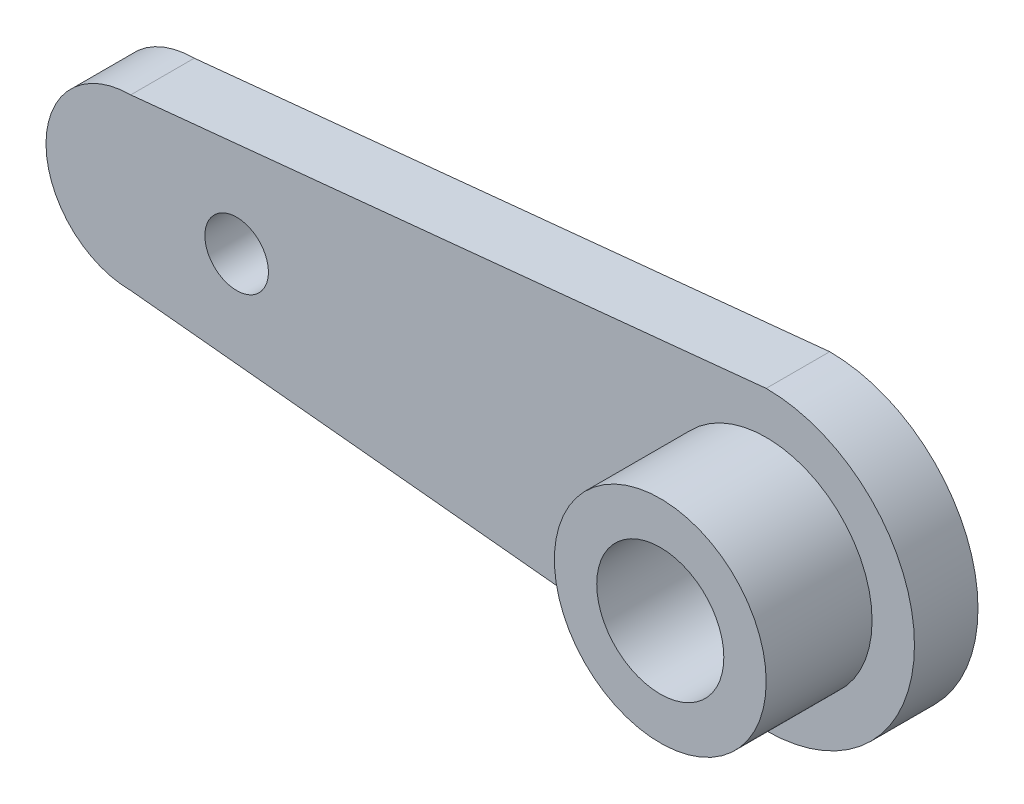
ISO-10303-21;
HEADER;
FILE_DESCRIPTION(('STEP AP214'),'2;1');
FILE_NAME('part.step','',(''),(''),'','','');
FILE_SCHEMA(('AUTOMOTIVE_DESIGN { 1 0 10303 214 1 1 1 1 }'));
ENDSEC;
DATA;
#1=APPLICATION_CONTEXT('core data for automotive mechanical design processes');
#2=APPLICATION_PROTOCOL_DEFINITION('international standard','automotive_design',2000,#1);
#3=PRODUCT_CONTEXT('',#1,'mechanical');
#4=PRODUCT('Part','Part','',(#3));
#5=PRODUCT_RELATED_PRODUCT_CATEGORY('part','',(#4));
#6=PRODUCT_DEFINITION_FORMATION('','',#4);
#7=PRODUCT_DEFINITION_CONTEXT('part definition',#1,'design');
#8=PRODUCT_DEFINITION('design','',#6,#7);
#9=PRODUCT_DEFINITION_SHAPE('','',#8);
#10=(LENGTH_UNIT() NAMED_UNIT(*) SI_UNIT(.MILLI.,.METRE.));
#11=(NAMED_UNIT(*) PLANE_ANGLE_UNIT() SI_UNIT($,.RADIAN.));
#12=(NAMED_UNIT(*) SI_UNIT($,.STERADIAN.) SOLID_ANGLE_UNIT());
#13=UNCERTAINTY_MEASURE_WITH_UNIT(LENGTH_MEASURE(1.E-05),#10,'distance_accuracy_value','');
#14=(GEOMETRIC_REPRESENTATION_CONTEXT(3) GLOBAL_UNCERTAINTY_ASSIGNED_CONTEXT((#13)) GLOBAL_UNIT_ASSIGNED_CONTEXT((#10,
#11,#12)) REPRESENTATION_CONTEXT('',''));
#15=CARTESIAN_POINT('',(0.,0.,0.));
#16=DIRECTION('',(0.,0.,1.));
#17=DIRECTION('',(1.,0.,0.));
#18=AXIS2_PLACEMENT_3D('',#15,#16,#17);
#19=CARTESIAN_POINT('',(0.,0.,0.));
#20=DIRECTION('',(0.,0.,-1.));
#21=DIRECTION('',(1.,0.,0.));
#22=AXIS2_PLACEMENT_3D('',#19,#20,#21);
#23=PLANE('',#22);
#24=CARTESIAN_POINT('',(0.,0.,0.));
#25=DIRECTION('',(0.,0.,1.));
#26=DIRECTION('',(1.,0.,0.));
#27=AXIS2_PLACEMENT_3D('',#24,#25,#26);
#28=CIRCLE('',#27,5.);
#29=CARTESIAN_POINT('',(5.,0.,0.));
#30=VERTEX_POINT('',#29);
#31=EDGE_CURVE('E39',#30,#30,#28,.T.);
#32=ORIENTED_EDGE('',*,*,#31,.T.);
#33=EDGE_LOOP('',(#32));
#34=FACE_BOUND('',#33,.T.);
#35=CARTESIAN_POINT('',(0.,0.,0.));
#36=DIRECTION('',(0.,0.,1.));
#37=DIRECTION('',(1.,0.,0.));
#38=AXIS2_PLACEMENT_3D('',#35,#36,#37);
#39=CIRCLE('',#38,3.);
#40=CARTESIAN_POINT('',(3.,0.,0.));
#41=VERTEX_POINT('',#40);
#42=EDGE_CURVE('E114',#41,#41,#39,.T.);
#43=ORIENTED_EDGE('',*,*,#42,.F.);
#44=EDGE_LOOP('',(#43));
#45=FACE_BOUND('',#44,.T.);
#46=ADVANCED_FACE('F35',(#34,#45),#23,.F.);
#47=CARTESIAN_POINT('',(0.,0.,-5.));
#48=DIRECTION('',(0.,0.,1.));
#49=DIRECTION('',(-1.,0.,0.));
#50=AXIS2_PLACEMENT_3D('',#47,#48,#49);
#51=CYLINDRICAL_SURFACE('',#50,5.);
#52=CARTESIAN_POINT('',(0.,0.,-5.));
#53=DIRECTION('',(0.,0.,1.));
#54=DIRECTION('',(1.,0.,0.));
#55=AXIS2_PLACEMENT_3D('',#52,#53,#54);
#56=CIRCLE('',#55,5.);
#57=CARTESIAN_POINT('',(5.,0.,-5.));
#58=VERTEX_POINT('',#57);
#59=EDGE_CURVE('E11',#58,#58,#56,.T.);
#60=ORIENTED_EDGE('',*,*,#59,.T.);
#61=EDGE_LOOP('',(#60));
#62=FACE_BOUND('',#61,.T.);
#63=ORIENTED_EDGE('',*,*,#31,.F.);
#64=EDGE_LOOP('',(#63));
#65=FACE_BOUND('',#64,.T.);
#66=ADVANCED_FACE('F37',(#62,#65),#51,.T.);
#67=CARTESIAN_POINT('',(0.,0.,-5.));
#68=DIRECTION('',(0.,0.,1.));
#69=DIRECTION('',(-1.,0.,0.));
#70=AXIS2_PLACEMENT_3D('',#67,#68,#69);
#71=CYLINDRICAL_SURFACE('',#70,3.);
#72=ORIENTED_EDGE('',*,*,#42,.T.);
#73=EDGE_LOOP('',(#72));
#74=FACE_BOUND('',#73,.T.);
#75=CARTESIAN_POINT('',(0.,0.,-8.));
#76=DIRECTION('',(0.,0.,-1.));
#77=DIRECTION('',(-1.,0.,0.));
#78=AXIS2_PLACEMENT_3D('',#75,#76,#77);
#79=CIRCLE('',#78,3.);
#80=CARTESIAN_POINT('',(-3.,0.,-8.));
#81=VERTEX_POINT('',#80);
#82=EDGE_CURVE('E203',#81,#81,#79,.T.);
#83=ORIENTED_EDGE('',*,*,#82,.T.);
#84=EDGE_LOOP('',(#83));
#85=FACE_BOUND('',#84,.T.);
#86=ADVANCED_FACE('F124',(#74,#85),#71,.F.);
#87=CARTESIAN_POINT('',(-30.,0.,-8.));
#88=DIRECTION('',(0.,0.,1.));
#89=DIRECTION('',(-1.,0.,0.));
#90=AXIS2_PLACEMENT_3D('',#87,#88,#89);
#91=CYLINDRICAL_SURFACE('',#90,4.);
#92=CARTESIAN_POINT('',(-30.,0.,-5.));
#93=DIRECTION('',(0.,0.,1.));
#94=DIRECTION('',(1.,0.,0.));
#95=AXIS2_PLACEMENT_3D('',#92,#93,#94);
#96=CIRCLE('',#95,4.);
#97=CARTESIAN_POINT('',(-30.,4.,-5.));
#98=VERTEX_POINT('',#97);
#99=CARTESIAN_POINT('',(-30.,-4.,-5.));
#100=VERTEX_POINT('',#99);
#101=EDGE_CURVE('E104',#98,#100,#96,.T.);
#102=ORIENTED_EDGE('',*,*,#101,.F.);
#103=DIRECTION('',(0.,0.,1.));
#104=VECTOR('',#103,1.);
#105=CARTESIAN_POINT('',(-30.,4.,-8.));
#106=LINE('',#105,#104);
#107=CARTESIAN_POINT('',(-30.,4.,-8.));
#108=VERTEX_POINT('',#107);
#109=EDGE_CURVE('E103',#108,#98,#106,.T.);
#110=ORIENTED_EDGE('',*,*,#109,.F.);
#111=CARTESIAN_POINT('',(-30.,0.,-8.));
#112=DIRECTION('',(0.,0.,1.));
#113=DIRECTION('',(1.,0.,0.));
#114=AXIS2_PLACEMENT_3D('',#111,#112,#113);
#115=CIRCLE('',#114,4.);
#116=CARTESIAN_POINT('',(-30.,-4.,-8.));
#117=VERTEX_POINT('',#116);
#118=EDGE_CURVE('E97',#108,#117,#115,.T.);
#119=ORIENTED_EDGE('',*,*,#118,.T.);
#120=DIRECTION('',(0.,0.,1.));
#121=VECTOR('',#120,1.);
#122=CARTESIAN_POINT('',(-30.,-4.,-8.));
#123=LINE('',#122,#121);
#124=EDGE_CURVE('E91',#117,#100,#123,.T.);
#125=ORIENTED_EDGE('',*,*,#124,.T.);
#126=EDGE_LOOP('',(#102,#110,#119,#125));
#127=FACE_BOUND('',#126,.T.);
#128=ADVANCED_FACE('F130',(#127),#91,.T.);
#129=CARTESIAN_POINT('',(-30.,-4.,-8.));
#130=DIRECTION('',(0.099503719020999,0.995037190209989,0.));
#131=DIRECTION('',(-0.995037190209989,0.099503719020999,0.));
#132=AXIS2_PLACEMENT_3D('',#129,#130,#131);
#133=PLANE('',#132);
#134=DIRECTION('',(0.995037190209989,-0.0995037190209989,0.));
#135=VECTOR('',#134,1.);
#136=CARTESIAN_POINT('',(-30.,-4.,-5.));
#137=LINE('',#136,#135);
#138=CARTESIAN_POINT('',(0.,-7.,-5.));
#139=VERTEX_POINT('',#138);
#140=EDGE_CURVE('E106',#100,#139,#137,.T.);
#141=ORIENTED_EDGE('',*,*,#140,.F.);
#142=ORIENTED_EDGE('',*,*,#124,.F.);
#143=DIRECTION('',(0.995037190209989,-0.0995037190209989,0.));
#144=VECTOR('',#143,1.);
#145=CARTESIAN_POINT('',(-30.,-4.,-8.));
#146=LINE('',#145,#144);
#147=CARTESIAN_POINT('',(0.,-7.,-8.));
#148=VERTEX_POINT('',#147);
#149=EDGE_CURVE('E77',#117,#148,#146,.T.);
#150=ORIENTED_EDGE('',*,*,#149,.T.);
#151=DIRECTION('',(0.,0.,1.));
#152=VECTOR('',#151,1.);
#153=CARTESIAN_POINT('',(0.,-7.,-8.));
#154=LINE('',#153,#152);
#155=EDGE_CURVE('E86',#148,#139,#154,.T.);
#156=ORIENTED_EDGE('',*,*,#155,.T.);
#157=EDGE_LOOP('',(#141,#142,#150,#156));
#158=FACE_BOUND('',#157,.T.);
#159=ADVANCED_FACE('F94',(#158),#133,.F.);
#160=CARTESIAN_POINT('',(0.,0.,-8.));
#161=DIRECTION('',(0.,0.,1.));
#162=DIRECTION('',(-1.,0.,0.));
#163=AXIS2_PLACEMENT_3D('',#160,#161,#162);
#164=CYLINDRICAL_SURFACE('',#163,7.);
#165=CARTESIAN_POINT('',(0.,0.,-5.));
#166=DIRECTION('',(0.,0.,1.));
#167=DIRECTION('',(1.,0.,0.));
#168=AXIS2_PLACEMENT_3D('',#165,#166,#167);
#169=CIRCLE('',#168,7.);
#170=CARTESIAN_POINT('',(0.,7.,-5.));
#171=VERTEX_POINT('',#170);
#172=EDGE_CURVE('E88',#139,#171,#169,.T.);
#173=ORIENTED_EDGE('',*,*,#172,.F.);
#174=ORIENTED_EDGE('',*,*,#155,.F.);
#175=CARTESIAN_POINT('',(0.,0.,-8.));
#176=DIRECTION('',(0.,0.,1.));
#177=DIRECTION('',(1.,0.,0.));
#178=AXIS2_PLACEMENT_3D('',#175,#176,#177);
#179=CIRCLE('',#178,7.);
#180=CARTESIAN_POINT('',(0.,7.,-8.));
#181=VERTEX_POINT('',#180);
#182=EDGE_CURVE('E80',#148,#181,#179,.T.);
#183=ORIENTED_EDGE('',*,*,#182,.T.);
#184=DIRECTION('',(0.,0.,1.));
#185=VECTOR('',#184,1.);
#186=CARTESIAN_POINT('',(0.,7.,-8.));
#187=LINE('',#186,#185);
#188=EDGE_CURVE('E92',#181,#171,#187,.T.);
#189=ORIENTED_EDGE('',*,*,#188,.T.);
#190=EDGE_LOOP('',(#173,#174,#183,#189));
#191=FACE_BOUND('',#190,.T.);
#192=ADVANCED_FACE('F87',(#191),#164,.T.);
#193=CARTESIAN_POINT('',(-30.,4.,-8.));
#194=DIRECTION('',(0.099503719020999,-0.995037190209989,0.));
#195=DIRECTION('',(0.995037190209989,0.099503719020999,0.));
#196=AXIS2_PLACEMENT_3D('',#193,#194,#195);
#197=PLANE('',#196);
#198=DIRECTION('',(-0.995037190209989,-0.0995037190209989,0.));
#199=VECTOR('',#198,1.);
#200=CARTESIAN_POINT('',(-30.,4.,-5.));
#201=LINE('',#200,#199);
#202=EDGE_CURVE('E66',#171,#98,#201,.T.);
#203=ORIENTED_EDGE('',*,*,#202,.F.);
#204=ORIENTED_EDGE('',*,*,#188,.F.);
#205=DIRECTION('',(-0.995037190209989,-0.0995037190209989,0.));
#206=VECTOR('',#205,1.);
#207=CARTESIAN_POINT('',(-30.,4.,-8.));
#208=LINE('',#207,#206);
#209=EDGE_CURVE('E52',#181,#108,#208,.T.);
#210=ORIENTED_EDGE('',*,*,#209,.T.);
#211=ORIENTED_EDGE('',*,*,#109,.T.);
#212=EDGE_LOOP('',(#203,#204,#210,#211));
#213=FACE_BOUND('',#212,.T.);
#214=ADVANCED_FACE('F142',(#213),#197,.F.);
#215=CARTESIAN_POINT('',(-30.,0.,-8.));
#216=DIRECTION('',(0.,0.,-1.));
#217=DIRECTION('',(1.,0.,0.));
#218=AXIS2_PLACEMENT_3D('',#215,#216,#217);
#219=PLANE('',#218);
#220=ORIENTED_EDGE('',*,*,#82,.F.);
#221=EDGE_LOOP('',(#220));
#222=FACE_BOUND('',#221,.T.);
#223=CARTESIAN_POINT('',(-25.,0.,-8.));
#224=DIRECTION('',(0.,0.,-1.));
#225=DIRECTION('',(-1.,0.,0.));
#226=AXIS2_PLACEMENT_3D('',#223,#224,#225);
#227=CIRCLE('',#226,1.5);
#228=CARTESIAN_POINT('',(-26.5,0.,-8.));
#229=VERTEX_POINT('',#228);
#230=EDGE_CURVE('E107',#229,#229,#227,.T.);
#231=ORIENTED_EDGE('',*,*,#230,.F.);
#232=EDGE_LOOP('',(#231));
#233=FACE_BOUND('',#232,.T.);
#234=ORIENTED_EDGE('',*,*,#118,.F.);
#235=ORIENTED_EDGE('',*,*,#209,.F.);
#236=ORIENTED_EDGE('',*,*,#182,.F.);
#237=ORIENTED_EDGE('',*,*,#149,.F.);
#238=EDGE_LOOP('',(#234,#235,#236,#237));
#239=FACE_BOUND('',#238,.T.);
#240=ADVANCED_FACE('F82',(#222,#233,#239),#219,.T.);
#241=CARTESIAN_POINT('',(-30.,0.,-5.));
#242=DIRECTION('',(0.,0.,-1.));
#243=DIRECTION('',(1.,0.,0.));
#244=AXIS2_PLACEMENT_3D('',#241,#242,#243);
#245=PLANE('',#244);
#246=CARTESIAN_POINT('',(-25.,0.,-5.));
#247=DIRECTION('',(0.,0.,-1.));
#248=DIRECTION('',(-1.,0.,0.));
#249=AXIS2_PLACEMENT_3D('',#246,#247,#248);
#250=CIRCLE('',#249,1.5);
#251=CARTESIAN_POINT('',(-26.5,0.,-5.));
#252=VERTEX_POINT('',#251);
#253=EDGE_CURVE('E202',#252,#252,#250,.T.);
#254=ORIENTED_EDGE('',*,*,#253,.T.);
#255=EDGE_LOOP('',(#254));
#256=FACE_BOUND('',#255,.T.);
#257=ORIENTED_EDGE('',*,*,#59,.F.);
#258=EDGE_LOOP('',(#257));
#259=FACE_BOUND('',#258,.T.);
#260=ORIENTED_EDGE('',*,*,#101,.T.);
#261=ORIENTED_EDGE('',*,*,#140,.T.);
#262=ORIENTED_EDGE('',*,*,#172,.T.);
#263=ORIENTED_EDGE('',*,*,#202,.T.);
#264=EDGE_LOOP('',(#260,#261,#262,#263));
#265=FACE_BOUND('',#264,.T.);
#266=ADVANCED_FACE('F134',(#256,#259,#265),#245,.F.);
#267=CARTESIAN_POINT('',(-25.,0.,-8.));
#268=DIRECTION('',(0.,0.,1.));
#269=DIRECTION('',(-1.,0.,0.));
#270=AXIS2_PLACEMENT_3D('',#267,#268,#269);
#271=CYLINDRICAL_SURFACE('',#270,1.5);
#272=ORIENTED_EDGE('',*,*,#230,.T.);
#273=EDGE_LOOP('',(#272));
#274=FACE_BOUND('',#273,.T.);
#275=ORIENTED_EDGE('',*,*,#253,.F.);
#276=EDGE_LOOP('',(#275));
#277=FACE_BOUND('',#276,.T.);
#278=ADVANCED_FACE('F136',(#274,#277),#271,.F.);
#279=CLOSED_SHELL('',(#46,#66,#86,#128,#159,#192,#214,#240,#266,#278));
#280=MANIFOLD_SOLID_BREP('B2',#279);
#281=ADVANCED_BREP_SHAPE_REPRESENTATION('',(#18,#280),#14);
#282=SHAPE_DEFINITION_REPRESENTATION(#9,#281);
ENDSEC;
END-ISO-10303-21;
